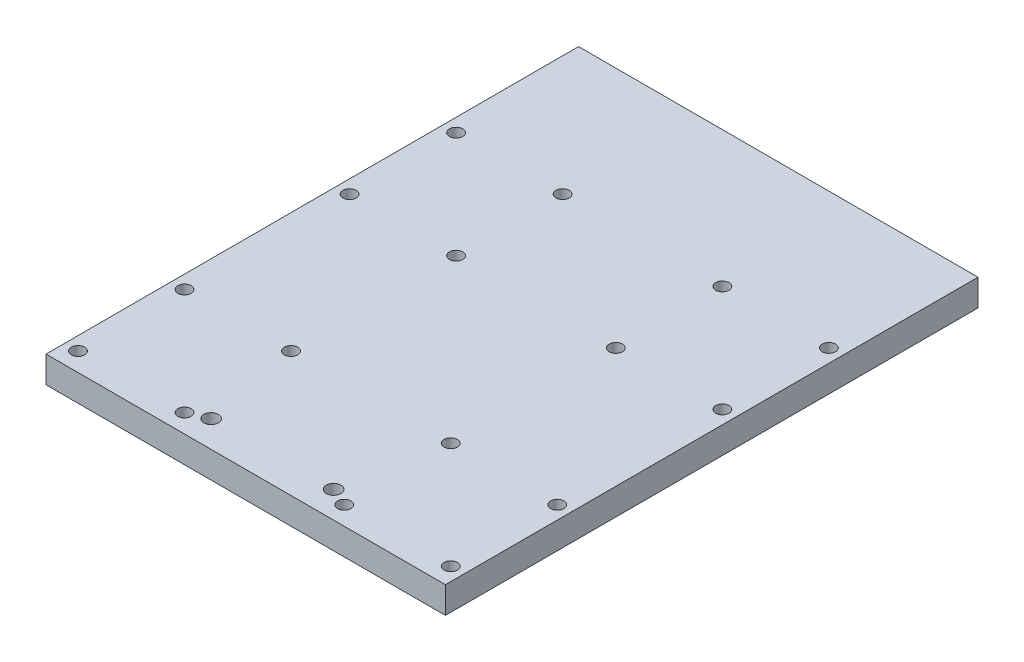
ISO-10303-21;
HEADER;
FILE_DESCRIPTION(('STEP AP214'),'2;1');
FILE_NAME('part.step','',(''),(''),'','','');
FILE_SCHEMA(('AUTOMOTIVE_DESIGN { 1 0 10303 214 1 1 1 1 }'));
ENDSEC;
DATA;
#1=APPLICATION_CONTEXT('core data for automotive mechanical design processes');
#2=APPLICATION_PROTOCOL_DEFINITION('international standard','automotive_design',2000,#1);
#3=PRODUCT_CONTEXT('',#1,'mechanical');
#4=PRODUCT('Part','Part','',(#3));
#5=PRODUCT_RELATED_PRODUCT_CATEGORY('part','',(#4));
#6=PRODUCT_DEFINITION_FORMATION('','',#4);
#7=PRODUCT_DEFINITION_CONTEXT('part definition',#1,'design');
#8=PRODUCT_DEFINITION('design','',#6,#7);
#9=PRODUCT_DEFINITION_SHAPE('','',#8);
#10=(LENGTH_UNIT() NAMED_UNIT(*) SI_UNIT(.MILLI.,.METRE.));
#11=(NAMED_UNIT(*) PLANE_ANGLE_UNIT() SI_UNIT($,.RADIAN.));
#12=(NAMED_UNIT(*) SI_UNIT($,.STERADIAN.) SOLID_ANGLE_UNIT());
#13=UNCERTAINTY_MEASURE_WITH_UNIT(LENGTH_MEASURE(1.E-05),#10,'distance_accuracy_value','');
#14=(GEOMETRIC_REPRESENTATION_CONTEXT(3) GLOBAL_UNCERTAINTY_ASSIGNED_CONTEXT((#13)) GLOBAL_UNIT_ASSIGNED_CONTEXT((#10,
#11,#12)) REPRESENTATION_CONTEXT('',''));
#15=CARTESIAN_POINT('',(0.,0.,0.));
#16=DIRECTION('',(0.,0.,1.));
#17=DIRECTION('',(1.,0.,0.));
#18=AXIS2_PLACEMENT_3D('',#15,#16,#17);
#19=CARTESIAN_POINT('',(-75.,10.,100.));
#20=DIRECTION('',(1.,0.,0.));
#21=DIRECTION('',(0.,0.,-1.));
#22=AXIS2_PLACEMENT_3D('',#19,#20,#21);
#23=PLANE('',#22);
#24=DIRECTION('',(0.,0.,1.));
#25=VECTOR('',#24,1.);
#26=CARTESIAN_POINT('',(-75.,0.,100.));
#27=LINE('',#26,#25);
#28=CARTESIAN_POINT('',(-75.,0.,-100.));
#29=VERTEX_POINT('',#28);
#30=CARTESIAN_POINT('',(-75.,0.,100.));
#31=VERTEX_POINT('',#30);
#32=EDGE_CURVE('E96',#29,#31,#27,.T.);
#33=ORIENTED_EDGE('',*,*,#32,.T.);
#34=DIRECTION('',(0.,-1.,0.));
#35=VECTOR('',#34,1.);
#36=CARTESIAN_POINT('',(-75.,10.,100.));
#37=LINE('',#36,#35);
#38=CARTESIAN_POINT('',(-75.,10.,100.));
#39=VERTEX_POINT('',#38);
#40=EDGE_CURVE('E11',#39,#31,#37,.T.);
#41=ORIENTED_EDGE('',*,*,#40,.F.);
#42=DIRECTION('',(0.,0.,1.));
#43=VECTOR('',#42,1.);
#44=CARTESIAN_POINT('',(-75.,10.,100.));
#45=LINE('',#44,#43);
#46=CARTESIAN_POINT('',(-75.,10.,-100.));
#47=VERTEX_POINT('',#46);
#48=EDGE_CURVE('E84',#47,#39,#45,.T.);
#49=ORIENTED_EDGE('',*,*,#48,.F.);
#50=DIRECTION('',(0.,-1.,0.));
#51=VECTOR('',#50,1.);
#52=CARTESIAN_POINT('',(-75.,10.,-100.));
#53=LINE('',#52,#51);
#54=EDGE_CURVE('E92',#47,#29,#53,.T.);
#55=ORIENTED_EDGE('',*,*,#54,.T.);
#56=EDGE_LOOP('',(#33,#41,#49,#55));
#57=FACE_BOUND('',#56,.T.);
#58=ADVANCED_FACE('F33',(#57),#23,.F.);
#59=CARTESIAN_POINT('',(75.,10.,100.));
#60=DIRECTION('',(0.,0.,-1.));
#61=DIRECTION('',(-1.,0.,0.));
#62=AXIS2_PLACEMENT_3D('',#59,#60,#61);
#63=PLANE('',#62);
#64=DIRECTION('',(1.,0.,0.));
#65=VECTOR('',#64,1.);
#66=CARTESIAN_POINT('',(75.,0.,100.));
#67=LINE('',#66,#65);
#68=CARTESIAN_POINT('',(75.,0.,100.));
#69=VERTEX_POINT('',#68);
#70=EDGE_CURVE('E88',#31,#69,#67,.T.);
#71=ORIENTED_EDGE('',*,*,#70,.T.);
#72=DIRECTION('',(0.,-1.,0.));
#73=VECTOR('',#72,1.);
#74=CARTESIAN_POINT('',(75.,10.,100.));
#75=LINE('',#74,#73);
#76=CARTESIAN_POINT('',(75.,10.,100.));
#77=VERTEX_POINT('',#76);
#78=EDGE_CURVE('E41',#77,#69,#75,.T.);
#79=ORIENTED_EDGE('',*,*,#78,.F.);
#80=DIRECTION('',(1.,0.,0.));
#81=VECTOR('',#80,1.);
#82=CARTESIAN_POINT('',(75.,10.,100.));
#83=LINE('',#82,#81);
#84=EDGE_CURVE('E79',#39,#77,#83,.T.);
#85=ORIENTED_EDGE('',*,*,#84,.F.);
#86=ORIENTED_EDGE('',*,*,#40,.T.);
#87=EDGE_LOOP('',(#71,#79,#85,#86));
#88=FACE_BOUND('',#87,.T.);
#89=ADVANCED_FACE('F87',(#88),#63,.F.);
#90=CARTESIAN_POINT('',(75.,10.,100.));
#91=DIRECTION('',(-1.,0.,0.));
#92=DIRECTION('',(0.,0.,1.));
#93=AXIS2_PLACEMENT_3D('',#90,#91,#92);
#94=PLANE('',#93);
#95=DIRECTION('',(0.,0.,-1.));
#96=VECTOR('',#95,1.);
#97=CARTESIAN_POINT('',(75.,0.,100.));
#98=LINE('',#97,#96);
#99=CARTESIAN_POINT('',(75.,0.,-100.));
#100=VERTEX_POINT('',#99);
#101=EDGE_CURVE('E66',#69,#100,#98,.T.);
#102=ORIENTED_EDGE('',*,*,#101,.T.);
#103=DIRECTION('',(0.,-1.,0.));
#104=VECTOR('',#103,1.);
#105=CARTESIAN_POINT('',(75.,10.,-100.));
#106=LINE('',#105,#104);
#107=CARTESIAN_POINT('',(75.,10.,-100.));
#108=VERTEX_POINT('',#107);
#109=EDGE_CURVE('E89',#108,#100,#106,.T.);
#110=ORIENTED_EDGE('',*,*,#109,.F.);
#111=DIRECTION('',(0.,0.,-1.));
#112=VECTOR('',#111,1.);
#113=CARTESIAN_POINT('',(75.,10.,100.));
#114=LINE('',#113,#112);
#115=EDGE_CURVE('E82',#77,#108,#114,.T.);
#116=ORIENTED_EDGE('',*,*,#115,.F.);
#117=ORIENTED_EDGE('',*,*,#78,.T.);
#118=EDGE_LOOP('',(#102,#110,#116,#117));
#119=FACE_BOUND('',#118,.T.);
#120=ADVANCED_FACE('F90',(#119),#94,.F.);
#121=CARTESIAN_POINT('',(75.,10.,-100.));
#122=DIRECTION('',(0.,0.,1.));
#123=DIRECTION('',(1.,0.,0.));
#124=AXIS2_PLACEMENT_3D('',#121,#122,#123);
#125=PLANE('',#124);
#126=DIRECTION('',(-1.,0.,0.));
#127=VECTOR('',#126,1.);
#128=CARTESIAN_POINT('',(75.,0.,-100.));
#129=LINE('',#128,#127);
#130=EDGE_CURVE('E72',#100,#29,#129,.T.);
#131=ORIENTED_EDGE('',*,*,#130,.T.);
#132=ORIENTED_EDGE('',*,*,#54,.F.);
#133=DIRECTION('',(-1.,0.,0.));
#134=VECTOR('',#133,1.);
#135=CARTESIAN_POINT('',(75.,10.,-100.));
#136=LINE('',#135,#134);
#137=EDGE_CURVE('E49',#108,#47,#136,.T.);
#138=ORIENTED_EDGE('',*,*,#137,.F.);
#139=ORIENTED_EDGE('',*,*,#109,.T.);
#140=EDGE_LOOP('',(#131,#132,#138,#139));
#141=FACE_BOUND('',#140,.T.);
#142=ADVANCED_FACE('F104',(#141),#125,.F.);
#143=CARTESIAN_POINT('',(0.,10.,0.));
#144=DIRECTION('',(0.,1.,0.));
#145=DIRECTION('',(0.,0.,1.));
#146=AXIS2_PLACEMENT_3D('',#143,#144,#145);
#147=PLANE('',#146);
#148=CARTESIAN_POINT('',(23.,10.,90.0000000000001));
#149=DIRECTION('',(0.,-1.,0.));
#150=DIRECTION('',(0.,0.,1.));
#151=AXIS2_PLACEMENT_3D('',#148,#149,#150);
#152=CIRCLE('',#151,2.75);
#153=CARTESIAN_POINT('',(23.,10.,92.7500000000001));
#154=VERTEX_POINT('',#153);
#155=EDGE_CURVE('E209',#154,#154,#152,.T.);
#156=ORIENTED_EDGE('',*,*,#155,.T.);
#157=EDGE_LOOP('',(#156));
#158=FACE_BOUND('',#157,.T.);
#159=CARTESIAN_POINT('',(70.0000000000011,10.,-9.00000000000001));
#160=DIRECTION('',(0.,-1.,0.));
#161=DIRECTION('',(0.,0.,1.));
#162=AXIS2_PLACEMENT_3D('',#159,#160,#161);
#163=CIRCLE('',#162,2.50000000000001);
#164=CARTESIAN_POINT('',(70.0000000000011,10.,-6.5));
#165=VERTEX_POINT('',#164);
#166=EDGE_CURVE('E203',#165,#165,#163,.T.);
#167=ORIENTED_EDGE('',*,*,#166,.T.);
#168=EDGE_LOOP('',(#167));
#169=FACE_BOUND('',#168,.T.);
#170=CARTESIAN_POINT('',(30.0000000000011,10.,-9.00000000000001));
#171=DIRECTION('',(0.,-1.,0.));
#172=DIRECTION('',(0.,0.,1.));
#173=AXIS2_PLACEMENT_3D('',#170,#171,#172);
#174=CIRCLE('',#173,2.5);
#175=CARTESIAN_POINT('',(30.0000000000011,10.,-6.50000000000001));
#176=VERTEX_POINT('',#175);
#177=EDGE_CURVE('E197',#176,#176,#174,.T.);
#178=ORIENTED_EDGE('',*,*,#177,.T.);
#179=EDGE_LOOP('',(#178));
#180=FACE_BOUND('',#179,.T.);
#181=CARTESIAN_POINT('',(30.0000000000011,10.,-49.));
#182=DIRECTION('',(0.,-1.,0.));
#183=DIRECTION('',(0.,0.,1.));
#184=AXIS2_PLACEMENT_3D('',#181,#182,#183);
#185=CIRCLE('',#184,2.5);
#186=CARTESIAN_POINT('',(30.0000000000011,10.,-46.5));
#187=VERTEX_POINT('',#186);
#188=EDGE_CURVE('E191',#187,#187,#185,.T.);
#189=ORIENTED_EDGE('',*,*,#188,.T.);
#190=EDGE_LOOP('',(#189));
#191=FACE_BOUND('',#190,.T.);
#192=CARTESIAN_POINT('',(70.0000000000011,10.,-49.));
#193=DIRECTION('',(0.,-1.,0.));
#194=DIRECTION('',(0.,0.,1.));
#195=AXIS2_PLACEMENT_3D('',#192,#193,#194);
#196=CIRCLE('',#195,2.50000000000001);
#197=CARTESIAN_POINT('',(70.0000000000011,10.,-46.5));
#198=VERTEX_POINT('',#197);
#199=EDGE_CURVE('E185',#198,#198,#196,.T.);
#200=ORIENTED_EDGE('',*,*,#199,.T.);
#201=EDGE_LOOP('',(#200));
#202=FACE_BOUND('',#201,.T.);
#203=CARTESIAN_POINT('',(-69.9999999999989,10.,-49.));
#204=DIRECTION('',(0.,-1.,0.));
#205=DIRECTION('',(0.,0.,-1.));
#206=AXIS2_PLACEMENT_3D('',#203,#204,#205);
#207=CIRCLE('',#206,2.50000000000001);
#208=CARTESIAN_POINT('',(-69.9999999999989,10.,-51.5));
#209=VERTEX_POINT('',#208);
#210=EDGE_CURVE('E179',#209,#209,#207,.T.);
#211=ORIENTED_EDGE('',*,*,#210,.T.);
#212=EDGE_LOOP('',(#211));
#213=FACE_BOUND('',#212,.T.);
#214=CARTESIAN_POINT('',(-29.9999999999989,10.,-49.));
#215=DIRECTION('',(0.,-1.,0.));
#216=DIRECTION('',(0.,0.,-1.));
#217=AXIS2_PLACEMENT_3D('',#214,#215,#216);
#218=CIRCLE('',#217,2.5);
#219=CARTESIAN_POINT('',(-29.9999999999989,10.,-51.5));
#220=VERTEX_POINT('',#219);
#221=EDGE_CURVE('E173',#220,#220,#218,.T.);
#222=ORIENTED_EDGE('',*,*,#221,.T.);
#223=EDGE_LOOP('',(#222));
#224=FACE_BOUND('',#223,.T.);
#225=CARTESIAN_POINT('',(-29.9999999999989,10.,-9.00000000000002));
#226=DIRECTION('',(0.,-1.,0.));
#227=DIRECTION('',(0.,0.,-1.));
#228=AXIS2_PLACEMENT_3D('',#225,#226,#227);
#229=CIRCLE('',#228,2.5);
#230=CARTESIAN_POINT('',(-29.9999999999989,10.,-11.5));
#231=VERTEX_POINT('',#230);
#232=EDGE_CURVE('E167',#231,#231,#229,.T.);
#233=ORIENTED_EDGE('',*,*,#232,.T.);
#234=EDGE_LOOP('',(#233));
#235=FACE_BOUND('',#234,.T.);
#236=CARTESIAN_POINT('',(-69.9999999999989,10.,-9.00000000000002));
#237=DIRECTION('',(0.,-1.,0.));
#238=DIRECTION('',(0.,0.,-1.));
#239=AXIS2_PLACEMENT_3D('',#236,#237,#238);
#240=CIRCLE('',#239,2.50000000000001);
#241=CARTESIAN_POINT('',(-69.9999999999989,10.,-11.5));
#242=VERTEX_POINT('',#241);
#243=EDGE_CURVE('E161',#242,#242,#240,.T.);
#244=ORIENTED_EDGE('',*,*,#243,.T.);
#245=EDGE_LOOP('',(#244));
#246=FACE_BOUND('',#245,.T.);
#247=CARTESIAN_POINT('',(-23.,10.,90.0000000000001));
#248=DIRECTION('',(0.,-1.,0.));
#249=DIRECTION('',(0.,0.,-1.));
#250=AXIS2_PLACEMENT_3D('',#247,#248,#249);
#251=CIRCLE('',#250,2.75);
#252=CARTESIAN_POINT('',(-23.,10.,87.2500000000001));
#253=VERTEX_POINT('',#252);
#254=EDGE_CURVE('E155',#253,#253,#251,.T.);
#255=ORIENTED_EDGE('',*,*,#254,.T.);
#256=EDGE_LOOP('',(#255));
#257=FACE_BOUND('',#256,.T.);
#258=CARTESIAN_POINT('',(70.,10.,93.));
#259=DIRECTION('',(0.,-1.,0.));
#260=DIRECTION('',(0.,0.,1.));
#261=AXIS2_PLACEMENT_3D('',#258,#259,#260);
#262=CIRCLE('',#261,2.50000000000001);
#263=CARTESIAN_POINT('',(70.,10.,95.5));
#264=VERTEX_POINT('',#263);
#265=EDGE_CURVE('E149',#264,#264,#262,.T.);
#266=ORIENTED_EDGE('',*,*,#265,.T.);
#267=EDGE_LOOP('',(#266));
#268=FACE_BOUND('',#267,.T.);
#269=CARTESIAN_POINT('',(30.,10.,93.));
#270=DIRECTION('',(0.,-1.,0.));
#271=DIRECTION('',(0.,0.,1.));
#272=AXIS2_PLACEMENT_3D('',#269,#270,#271);
#273=CIRCLE('',#272,2.5);
#274=CARTESIAN_POINT('',(30.,10.,95.5));
#275=VERTEX_POINT('',#274);
#276=EDGE_CURVE('E143',#275,#275,#273,.T.);
#277=ORIENTED_EDGE('',*,*,#276,.T.);
#278=EDGE_LOOP('',(#277));
#279=FACE_BOUND('',#278,.T.);
#280=CARTESIAN_POINT('',(30.,10.,53.));
#281=DIRECTION('',(0.,-1.,0.));
#282=DIRECTION('',(0.,0.,1.));
#283=AXIS2_PLACEMENT_3D('',#280,#281,#282);
#284=CIRCLE('',#283,2.5);
#285=CARTESIAN_POINT('',(30.,10.,55.5));
#286=VERTEX_POINT('',#285);
#287=EDGE_CURVE('E137',#286,#286,#284,.T.);
#288=ORIENTED_EDGE('',*,*,#287,.T.);
#289=EDGE_LOOP('',(#288));
#290=FACE_BOUND('',#289,.T.);
#291=CARTESIAN_POINT('',(70.,10.,53.));
#292=DIRECTION('',(0.,-1.,0.));
#293=DIRECTION('',(0.,0.,1.));
#294=AXIS2_PLACEMENT_3D('',#291,#292,#293);
#295=CIRCLE('',#294,2.5);
#296=CARTESIAN_POINT('',(70.,10.,55.5));
#297=VERTEX_POINT('',#296);
#298=EDGE_CURVE('E131',#297,#297,#295,.T.);
#299=ORIENTED_EDGE('',*,*,#298,.T.);
#300=EDGE_LOOP('',(#299));
#301=FACE_BOUND('',#300,.T.);
#302=CARTESIAN_POINT('',(-70.,10.,53.));
#303=DIRECTION('',(0.,-1.,0.));
#304=DIRECTION('',(0.,0.,-1.));
#305=AXIS2_PLACEMENT_3D('',#302,#303,#304);
#306=CIRCLE('',#305,2.5);
#307=CARTESIAN_POINT('',(-70.,10.,50.5));
#308=VERTEX_POINT('',#307);
#309=EDGE_CURVE('E125',#308,#308,#306,.T.);
#310=ORIENTED_EDGE('',*,*,#309,.T.);
#311=EDGE_LOOP('',(#310));
#312=FACE_BOUND('',#311,.T.);
#313=CARTESIAN_POINT('',(-30.,10.,53.));
#314=DIRECTION('',(0.,-1.,0.));
#315=DIRECTION('',(0.,0.,-1.));
#316=AXIS2_PLACEMENT_3D('',#313,#314,#315);
#317=CIRCLE('',#316,2.5);
#318=CARTESIAN_POINT('',(-30.,10.,50.5));
#319=VERTEX_POINT('',#318);
#320=EDGE_CURVE('E119',#319,#319,#317,.T.);
#321=ORIENTED_EDGE('',*,*,#320,.T.);
#322=EDGE_LOOP('',(#321));
#323=FACE_BOUND('',#322,.T.);
#324=CARTESIAN_POINT('',(-30.,10.,93.));
#325=DIRECTION('',(0.,-1.,0.));
#326=DIRECTION('',(0.,0.,-1.));
#327=AXIS2_PLACEMENT_3D('',#324,#325,#326);
#328=CIRCLE('',#327,2.5);
#329=CARTESIAN_POINT('',(-30.,10.,90.5));
#330=VERTEX_POINT('',#329);
#331=EDGE_CURVE('E113',#330,#330,#328,.T.);
#332=ORIENTED_EDGE('',*,*,#331,.T.);
#333=EDGE_LOOP('',(#332));
#334=FACE_BOUND('',#333,.T.);
#335=CARTESIAN_POINT('',(-70.,10.,93.));
#336=DIRECTION('',(0.,-1.,0.));
#337=DIRECTION('',(0.,0.,-1.));
#338=AXIS2_PLACEMENT_3D('',#335,#336,#337);
#339=CIRCLE('',#338,2.50000000000001);
#340=CARTESIAN_POINT('',(-70.,10.,90.5));
#341=VERTEX_POINT('',#340);
#342=EDGE_CURVE('E99',#341,#341,#339,.T.);
#343=ORIENTED_EDGE('',*,*,#342,.T.);
#344=EDGE_LOOP('',(#343));
#345=FACE_BOUND('',#344,.T.);
#346=ORIENTED_EDGE('',*,*,#48,.T.);
#347=ORIENTED_EDGE('',*,*,#84,.T.);
#348=ORIENTED_EDGE('',*,*,#115,.T.);
#349=ORIENTED_EDGE('',*,*,#137,.T.);
#350=EDGE_LOOP('',(#346,#347,#348,#349));
#351=FACE_BOUND('',#350,.T.);
#352=ADVANCED_FACE('F80',(#158,#169,#180,#191,#202,#213,#224,#235,#246,#257,#268,#279,#290,#301,
#312,#323,#334,#345,#351),#147,.T.);
#353=CARTESIAN_POINT('',(0.,0.,0.));
#354=DIRECTION('',(0.,1.,0.));
#355=DIRECTION('',(0.,0.,1.));
#356=AXIS2_PLACEMENT_3D('',#353,#354,#355);
#357=PLANE('',#356);
#358=CARTESIAN_POINT('',(23.,0.,90.0000000000001));
#359=DIRECTION('',(0.,-1.,0.));
#360=DIRECTION('',(0.,0.,1.));
#361=AXIS2_PLACEMENT_3D('',#358,#359,#360);
#362=CIRCLE('',#361,2.75);
#363=CARTESIAN_POINT('',(23.,0.,92.7500000000001));
#364=VERTEX_POINT('',#363);
#365=EDGE_CURVE('E212',#364,#364,#362,.T.);
#366=ORIENTED_EDGE('',*,*,#365,.F.);
#367=EDGE_LOOP('',(#366));
#368=FACE_BOUND('',#367,.T.);
#369=CARTESIAN_POINT('',(70.0000000000011,0.,-9.00000000000001));
#370=DIRECTION('',(0.,-1.,0.));
#371=DIRECTION('',(0.,0.,1.));
#372=AXIS2_PLACEMENT_3D('',#369,#370,#371);
#373=CIRCLE('',#372,2.50000000000001);
#374=CARTESIAN_POINT('',(70.0000000000011,0.,-6.5));
#375=VERTEX_POINT('',#374);
#376=EDGE_CURVE('E206',#375,#375,#373,.T.);
#377=ORIENTED_EDGE('',*,*,#376,.F.);
#378=EDGE_LOOP('',(#377));
#379=FACE_BOUND('',#378,.T.);
#380=CARTESIAN_POINT('',(30.0000000000011,0.,-9.00000000000001));
#381=DIRECTION('',(0.,-1.,0.));
#382=DIRECTION('',(0.,0.,1.));
#383=AXIS2_PLACEMENT_3D('',#380,#381,#382);
#384=CIRCLE('',#383,2.5);
#385=CARTESIAN_POINT('',(30.0000000000011,0.,-6.50000000000001));
#386=VERTEX_POINT('',#385);
#387=EDGE_CURVE('E200',#386,#386,#384,.T.);
#388=ORIENTED_EDGE('',*,*,#387,.F.);
#389=EDGE_LOOP('',(#388));
#390=FACE_BOUND('',#389,.T.);
#391=CARTESIAN_POINT('',(30.0000000000011,0.,-49.));
#392=DIRECTION('',(0.,-1.,0.));
#393=DIRECTION('',(0.,0.,1.));
#394=AXIS2_PLACEMENT_3D('',#391,#392,#393);
#395=CIRCLE('',#394,2.5);
#396=CARTESIAN_POINT('',(30.0000000000011,0.,-46.5));
#397=VERTEX_POINT('',#396);
#398=EDGE_CURVE('E194',#397,#397,#395,.T.);
#399=ORIENTED_EDGE('',*,*,#398,.F.);
#400=EDGE_LOOP('',(#399));
#401=FACE_BOUND('',#400,.T.);
#402=CARTESIAN_POINT('',(70.0000000000011,0.,-49.));
#403=DIRECTION('',(0.,-1.,0.));
#404=DIRECTION('',(0.,0.,1.));
#405=AXIS2_PLACEMENT_3D('',#402,#403,#404);
#406=CIRCLE('',#405,2.50000000000001);
#407=CARTESIAN_POINT('',(70.0000000000011,0.,-46.5));
#408=VERTEX_POINT('',#407);
#409=EDGE_CURVE('E188',#408,#408,#406,.T.);
#410=ORIENTED_EDGE('',*,*,#409,.F.);
#411=EDGE_LOOP('',(#410));
#412=FACE_BOUND('',#411,.T.);
#413=CARTESIAN_POINT('',(-69.9999999999989,0.,-49.));
#414=DIRECTION('',(0.,-1.,0.));
#415=DIRECTION('',(0.,0.,-1.));
#416=AXIS2_PLACEMENT_3D('',#413,#414,#415);
#417=CIRCLE('',#416,2.50000000000001);
#418=CARTESIAN_POINT('',(-69.9999999999989,0.,-51.5));
#419=VERTEX_POINT('',#418);
#420=EDGE_CURVE('E182',#419,#419,#417,.T.);
#421=ORIENTED_EDGE('',*,*,#420,.F.);
#422=EDGE_LOOP('',(#421));
#423=FACE_BOUND('',#422,.T.);
#424=CARTESIAN_POINT('',(-29.9999999999989,0.,-49.));
#425=DIRECTION('',(0.,-1.,0.));
#426=DIRECTION('',(0.,0.,-1.));
#427=AXIS2_PLACEMENT_3D('',#424,#425,#426);
#428=CIRCLE('',#427,2.5);
#429=CARTESIAN_POINT('',(-29.9999999999989,0.,-51.5));
#430=VERTEX_POINT('',#429);
#431=EDGE_CURVE('E176',#430,#430,#428,.T.);
#432=ORIENTED_EDGE('',*,*,#431,.F.);
#433=EDGE_LOOP('',(#432));
#434=FACE_BOUND('',#433,.T.);
#435=CARTESIAN_POINT('',(-29.9999999999989,0.,-9.00000000000002));
#436=DIRECTION('',(0.,-1.,0.));
#437=DIRECTION('',(0.,0.,-1.));
#438=AXIS2_PLACEMENT_3D('',#435,#436,#437);
#439=CIRCLE('',#438,2.5);
#440=CARTESIAN_POINT('',(-29.9999999999989,0.,-11.5));
#441=VERTEX_POINT('',#440);
#442=EDGE_CURVE('E170',#441,#441,#439,.T.);
#443=ORIENTED_EDGE('',*,*,#442,.F.);
#444=EDGE_LOOP('',(#443));
#445=FACE_BOUND('',#444,.T.);
#446=CARTESIAN_POINT('',(-69.9999999999989,0.,-9.00000000000002));
#447=DIRECTION('',(0.,-1.,0.));
#448=DIRECTION('',(0.,0.,-1.));
#449=AXIS2_PLACEMENT_3D('',#446,#447,#448);
#450=CIRCLE('',#449,2.50000000000001);
#451=CARTESIAN_POINT('',(-69.9999999999989,0.,-11.5));
#452=VERTEX_POINT('',#451);
#453=EDGE_CURVE('E164',#452,#452,#450,.T.);
#454=ORIENTED_EDGE('',*,*,#453,.F.);
#455=EDGE_LOOP('',(#454));
#456=FACE_BOUND('',#455,.T.);
#457=CARTESIAN_POINT('',(-23.,0.,90.0000000000001));
#458=DIRECTION('',(0.,-1.,0.));
#459=DIRECTION('',(0.,0.,-1.));
#460=AXIS2_PLACEMENT_3D('',#457,#458,#459);
#461=CIRCLE('',#460,2.75);
#462=CARTESIAN_POINT('',(-23.,0.,87.2500000000001));
#463=VERTEX_POINT('',#462);
#464=EDGE_CURVE('E158',#463,#463,#461,.T.);
#465=ORIENTED_EDGE('',*,*,#464,.F.);
#466=EDGE_LOOP('',(#465));
#467=FACE_BOUND('',#466,.T.);
#468=CARTESIAN_POINT('',(70.,0.,93.));
#469=DIRECTION('',(0.,-1.,0.));
#470=DIRECTION('',(0.,0.,1.));
#471=AXIS2_PLACEMENT_3D('',#468,#469,#470);
#472=CIRCLE('',#471,2.50000000000001);
#473=CARTESIAN_POINT('',(70.,0.,95.5));
#474=VERTEX_POINT('',#473);
#475=EDGE_CURVE('E152',#474,#474,#472,.T.);
#476=ORIENTED_EDGE('',*,*,#475,.F.);
#477=EDGE_LOOP('',(#476));
#478=FACE_BOUND('',#477,.T.);
#479=CARTESIAN_POINT('',(30.,0.,93.));
#480=DIRECTION('',(0.,-1.,0.));
#481=DIRECTION('',(0.,0.,1.));
#482=AXIS2_PLACEMENT_3D('',#479,#480,#481);
#483=CIRCLE('',#482,2.5);
#484=CARTESIAN_POINT('',(30.,0.,95.5));
#485=VERTEX_POINT('',#484);
#486=EDGE_CURVE('E146',#485,#485,#483,.T.);
#487=ORIENTED_EDGE('',*,*,#486,.F.);
#488=EDGE_LOOP('',(#487));
#489=FACE_BOUND('',#488,.T.);
#490=CARTESIAN_POINT('',(30.,0.,53.));
#491=DIRECTION('',(0.,-1.,0.));
#492=DIRECTION('',(0.,0.,1.));
#493=AXIS2_PLACEMENT_3D('',#490,#491,#492);
#494=CIRCLE('',#493,2.5);
#495=CARTESIAN_POINT('',(30.,0.,55.5));
#496=VERTEX_POINT('',#495);
#497=EDGE_CURVE('E140',#496,#496,#494,.T.);
#498=ORIENTED_EDGE('',*,*,#497,.F.);
#499=EDGE_LOOP('',(#498));
#500=FACE_BOUND('',#499,.T.);
#501=CARTESIAN_POINT('',(70.,0.,53.));
#502=DIRECTION('',(0.,-1.,0.));
#503=DIRECTION('',(0.,0.,1.));
#504=AXIS2_PLACEMENT_3D('',#501,#502,#503);
#505=CIRCLE('',#504,2.5);
#506=CARTESIAN_POINT('',(70.,0.,55.5));
#507=VERTEX_POINT('',#506);
#508=EDGE_CURVE('E134',#507,#507,#505,.T.);
#509=ORIENTED_EDGE('',*,*,#508,.F.);
#510=EDGE_LOOP('',(#509));
#511=FACE_BOUND('',#510,.T.);
#512=CARTESIAN_POINT('',(-70.,0.,53.));
#513=DIRECTION('',(0.,-1.,0.));
#514=DIRECTION('',(0.,0.,-1.));
#515=AXIS2_PLACEMENT_3D('',#512,#513,#514);
#516=CIRCLE('',#515,2.5);
#517=CARTESIAN_POINT('',(-70.,0.,50.5));
#518=VERTEX_POINT('',#517);
#519=EDGE_CURVE('E128',#518,#518,#516,.T.);
#520=ORIENTED_EDGE('',*,*,#519,.F.);
#521=EDGE_LOOP('',(#520));
#522=FACE_BOUND('',#521,.T.);
#523=CARTESIAN_POINT('',(-30.,0.,53.));
#524=DIRECTION('',(0.,-1.,0.));
#525=DIRECTION('',(0.,0.,-1.));
#526=AXIS2_PLACEMENT_3D('',#523,#524,#525);
#527=CIRCLE('',#526,2.5);
#528=CARTESIAN_POINT('',(-30.,0.,50.5));
#529=VERTEX_POINT('',#528);
#530=EDGE_CURVE('E122',#529,#529,#527,.T.);
#531=ORIENTED_EDGE('',*,*,#530,.F.);
#532=EDGE_LOOP('',(#531));
#533=FACE_BOUND('',#532,.T.);
#534=CARTESIAN_POINT('',(-30.,0.,93.));
#535=DIRECTION('',(0.,-1.,0.));
#536=DIRECTION('',(0.,0.,-1.));
#537=AXIS2_PLACEMENT_3D('',#534,#535,#536);
#538=CIRCLE('',#537,2.5);
#539=CARTESIAN_POINT('',(-30.,0.,90.5));
#540=VERTEX_POINT('',#539);
#541=EDGE_CURVE('E116',#540,#540,#538,.T.);
#542=ORIENTED_EDGE('',*,*,#541,.F.);
#543=EDGE_LOOP('',(#542));
#544=FACE_BOUND('',#543,.T.);
#545=CARTESIAN_POINT('',(-70.,0.,93.));
#546=DIRECTION('',(0.,-1.,0.));
#547=DIRECTION('',(0.,0.,-1.));
#548=AXIS2_PLACEMENT_3D('',#545,#546,#547);
#549=CIRCLE('',#548,2.50000000000001);
#550=CARTESIAN_POINT('',(-70.,0.,90.5));
#551=VERTEX_POINT('',#550);
#552=EDGE_CURVE('E110',#551,#551,#549,.T.);
#553=ORIENTED_EDGE('',*,*,#552,.F.);
#554=EDGE_LOOP('',(#553));
#555=FACE_BOUND('',#554,.T.);
#556=ORIENTED_EDGE('',*,*,#32,.F.);
#557=ORIENTED_EDGE('',*,*,#130,.F.);
#558=ORIENTED_EDGE('',*,*,#101,.F.);
#559=ORIENTED_EDGE('',*,*,#70,.F.);
#560=EDGE_LOOP('',(#556,#557,#558,#559));
#561=FACE_BOUND('',#560,.T.);
#562=ADVANCED_FACE('F107',(#368,#379,#390,#401,#412,#423,#434,#445,#456,#467,#478,#489,#500,
#511,#522,#533,#544,#555,#561),#357,.F.);
#563=CARTESIAN_POINT('',(-70.,10.,93.));
#564=DIRECTION('',(0.,-1.,0.));
#565=DIRECTION('',(0.,0.,-1.));
#566=AXIS2_PLACEMENT_3D('',#563,#564,#565);
#567=CYLINDRICAL_SURFACE('',#566,2.50000000000001);
#568=ORIENTED_EDGE('',*,*,#342,.F.);
#569=EDGE_LOOP('',(#568));
#570=FACE_BOUND('',#569,.T.);
#571=ORIENTED_EDGE('',*,*,#552,.T.);
#572=EDGE_LOOP('',(#571));
#573=FACE_BOUND('',#572,.T.);
#574=ADVANCED_FACE('F229',(#570,#573),#567,.F.);
#575=CARTESIAN_POINT('',(-30.,10.,93.));
#576=DIRECTION('',(0.,-1.,0.));
#577=DIRECTION('',(0.,0.,-1.));
#578=AXIS2_PLACEMENT_3D('',#575,#576,#577);
#579=CYLINDRICAL_SURFACE('',#578,2.5);
#580=ORIENTED_EDGE('',*,*,#331,.F.);
#581=EDGE_LOOP('',(#580));
#582=FACE_BOUND('',#581,.T.);
#583=ORIENTED_EDGE('',*,*,#541,.T.);
#584=EDGE_LOOP('',(#583));
#585=FACE_BOUND('',#584,.T.);
#586=ADVANCED_FACE('F266',(#582,#585),#579,.F.);
#587=CARTESIAN_POINT('',(-30.,10.,53.));
#588=DIRECTION('',(0.,-1.,0.));
#589=DIRECTION('',(0.,0.,-1.));
#590=AXIS2_PLACEMENT_3D('',#587,#588,#589);
#591=CYLINDRICAL_SURFACE('',#590,2.5);
#592=ORIENTED_EDGE('',*,*,#320,.F.);
#593=EDGE_LOOP('',(#592));
#594=FACE_BOUND('',#593,.T.);
#595=ORIENTED_EDGE('',*,*,#530,.T.);
#596=EDGE_LOOP('',(#595));
#597=FACE_BOUND('',#596,.T.);
#598=ADVANCED_FACE('F273',(#594,#597),#591,.F.);
#599=CARTESIAN_POINT('',(-70.,10.,53.));
#600=DIRECTION('',(0.,-1.,0.));
#601=DIRECTION('',(0.,0.,-1.));
#602=AXIS2_PLACEMENT_3D('',#599,#600,#601);
#603=CYLINDRICAL_SURFACE('',#602,2.5);
#604=ORIENTED_EDGE('',*,*,#309,.F.);
#605=EDGE_LOOP('',(#604));
#606=FACE_BOUND('',#605,.T.);
#607=ORIENTED_EDGE('',*,*,#519,.T.);
#608=EDGE_LOOP('',(#607));
#609=FACE_BOUND('',#608,.T.);
#610=ADVANCED_FACE('F315',(#606,#609),#603,.F.);
#611=CARTESIAN_POINT('',(70.,10.,53.));
#612=DIRECTION('',(0.,-1.,0.));
#613=DIRECTION('',(0.,0.,-1.));
#614=AXIS2_PLACEMENT_3D('',#611,#612,#613);
#615=CYLINDRICAL_SURFACE('',#614,2.5);
#616=ORIENTED_EDGE('',*,*,#298,.F.);
#617=EDGE_LOOP('',(#616));
#618=FACE_BOUND('',#617,.T.);
#619=ORIENTED_EDGE('',*,*,#508,.T.);
#620=EDGE_LOOP('',(#619));
#621=FACE_BOUND('',#620,.T.);
#622=ADVANCED_FACE('F325',(#618,#621),#615,.F.);
#623=CARTESIAN_POINT('',(30.,10.,53.));
#624=DIRECTION('',(0.,-1.,0.));
#625=DIRECTION('',(0.,0.,-1.));
#626=AXIS2_PLACEMENT_3D('',#623,#624,#625);
#627=CYLINDRICAL_SURFACE('',#626,2.5);
#628=ORIENTED_EDGE('',*,*,#287,.F.);
#629=EDGE_LOOP('',(#628));
#630=FACE_BOUND('',#629,.T.);
#631=ORIENTED_EDGE('',*,*,#497,.T.);
#632=EDGE_LOOP('',(#631));
#633=FACE_BOUND('',#632,.T.);
#634=ADVANCED_FACE('F335',(#630,#633),#627,.F.);
#635=CARTESIAN_POINT('',(30.,10.,93.));
#636=DIRECTION('',(0.,-1.,0.));
#637=DIRECTION('',(0.,0.,-1.));
#638=AXIS2_PLACEMENT_3D('',#635,#636,#637);
#639=CYLINDRICAL_SURFACE('',#638,2.5);
#640=ORIENTED_EDGE('',*,*,#276,.F.);
#641=EDGE_LOOP('',(#640));
#642=FACE_BOUND('',#641,.T.);
#643=ORIENTED_EDGE('',*,*,#486,.T.);
#644=EDGE_LOOP('',(#643));
#645=FACE_BOUND('',#644,.T.);
#646=ADVANCED_FACE('F345',(#642,#645),#639,.F.);
#647=CARTESIAN_POINT('',(70.,10.,93.));
#648=DIRECTION('',(0.,-1.,0.));
#649=DIRECTION('',(0.,0.,-1.));
#650=AXIS2_PLACEMENT_3D('',#647,#648,#649);
#651=CYLINDRICAL_SURFACE('',#650,2.50000000000001);
#652=ORIENTED_EDGE('',*,*,#265,.F.);
#653=EDGE_LOOP('',(#652));
#654=FACE_BOUND('',#653,.T.);
#655=ORIENTED_EDGE('',*,*,#475,.T.);
#656=EDGE_LOOP('',(#655));
#657=FACE_BOUND('',#656,.T.);
#658=ADVANCED_FACE('F355',(#654,#657),#651,.F.);
#659=CARTESIAN_POINT('',(-23.,10.,90.0000000000001));
#660=DIRECTION('',(0.,-1.,0.));
#661=DIRECTION('',(0.,0.,-1.));
#662=AXIS2_PLACEMENT_3D('',#659,#660,#661);
#663=CYLINDRICAL_SURFACE('',#662,2.75);
#664=ORIENTED_EDGE('',*,*,#254,.F.);
#665=EDGE_LOOP('',(#664));
#666=FACE_BOUND('',#665,.T.);
#667=ORIENTED_EDGE('',*,*,#464,.T.);
#668=EDGE_LOOP('',(#667));
#669=FACE_BOUND('',#668,.T.);
#670=ADVANCED_FACE('F365',(#666,#669),#663,.F.);
#671=CARTESIAN_POINT('',(-69.9999999999989,10.,-9.00000000000002));
#672=DIRECTION('',(0.,-1.,0.));
#673=DIRECTION('',(0.,0.,-1.));
#674=AXIS2_PLACEMENT_3D('',#671,#672,#673);
#675=CYLINDRICAL_SURFACE('',#674,2.50000000000001);
#676=ORIENTED_EDGE('',*,*,#243,.F.);
#677=EDGE_LOOP('',(#676));
#678=FACE_BOUND('',#677,.T.);
#679=ORIENTED_EDGE('',*,*,#453,.T.);
#680=EDGE_LOOP('',(#679));
#681=FACE_BOUND('',#680,.T.);
#682=ADVANCED_FACE('F375',(#678,#681),#675,.F.);
#683=CARTESIAN_POINT('',(-29.9999999999989,10.,-9.00000000000002));
#684=DIRECTION('',(0.,-1.,0.));
#685=DIRECTION('',(0.,0.,-1.));
#686=AXIS2_PLACEMENT_3D('',#683,#684,#685);
#687=CYLINDRICAL_SURFACE('',#686,2.5);
#688=ORIENTED_EDGE('',*,*,#232,.F.);
#689=EDGE_LOOP('',(#688));
#690=FACE_BOUND('',#689,.T.);
#691=ORIENTED_EDGE('',*,*,#442,.T.);
#692=EDGE_LOOP('',(#691));
#693=FACE_BOUND('',#692,.T.);
#694=ADVANCED_FACE('F385',(#690,#693),#687,.F.);
#695=CARTESIAN_POINT('',(-29.9999999999989,10.,-49.));
#696=DIRECTION('',(0.,-1.,0.));
#697=DIRECTION('',(0.,0.,-1.));
#698=AXIS2_PLACEMENT_3D('',#695,#696,#697);
#699=CYLINDRICAL_SURFACE('',#698,2.5);
#700=ORIENTED_EDGE('',*,*,#221,.F.);
#701=EDGE_LOOP('',(#700));
#702=FACE_BOUND('',#701,.T.);
#703=ORIENTED_EDGE('',*,*,#431,.T.);
#704=EDGE_LOOP('',(#703));
#705=FACE_BOUND('',#704,.T.);
#706=ADVANCED_FACE('F395',(#702,#705),#699,.F.);
#707=CARTESIAN_POINT('',(-69.9999999999989,10.,-49.));
#708=DIRECTION('',(0.,-1.,0.));
#709=DIRECTION('',(0.,0.,-1.));
#710=AXIS2_PLACEMENT_3D('',#707,#708,#709);
#711=CYLINDRICAL_SURFACE('',#710,2.50000000000001);
#712=ORIENTED_EDGE('',*,*,#210,.F.);
#713=EDGE_LOOP('',(#712));
#714=FACE_BOUND('',#713,.T.);
#715=ORIENTED_EDGE('',*,*,#420,.T.);
#716=EDGE_LOOP('',(#715));
#717=FACE_BOUND('',#716,.T.);
#718=ADVANCED_FACE('F405',(#714,#717),#711,.F.);
#719=CARTESIAN_POINT('',(70.0000000000011,10.,-49.));
#720=DIRECTION('',(0.,-1.,0.));
#721=DIRECTION('',(0.,0.,-1.));
#722=AXIS2_PLACEMENT_3D('',#719,#720,#721);
#723=CYLINDRICAL_SURFACE('',#722,2.50000000000001);
#724=ORIENTED_EDGE('',*,*,#199,.F.);
#725=EDGE_LOOP('',(#724));
#726=FACE_BOUND('',#725,.T.);
#727=ORIENTED_EDGE('',*,*,#409,.T.);
#728=EDGE_LOOP('',(#727));
#729=FACE_BOUND('',#728,.T.);
#730=ADVANCED_FACE('F415',(#726,#729),#723,.F.);
#731=CARTESIAN_POINT('',(30.0000000000011,10.,-49.));
#732=DIRECTION('',(0.,-1.,0.));
#733=DIRECTION('',(0.,0.,-1.));
#734=AXIS2_PLACEMENT_3D('',#731,#732,#733);
#735=CYLINDRICAL_SURFACE('',#734,2.5);
#736=ORIENTED_EDGE('',*,*,#188,.F.);
#737=EDGE_LOOP('',(#736));
#738=FACE_BOUND('',#737,.T.);
#739=ORIENTED_EDGE('',*,*,#398,.T.);
#740=EDGE_LOOP('',(#739));
#741=FACE_BOUND('',#740,.T.);
#742=ADVANCED_FACE('F425',(#738,#741),#735,.F.);
#743=CARTESIAN_POINT('',(30.0000000000011,10.,-9.00000000000001));
#744=DIRECTION('',(0.,-1.,0.));
#745=DIRECTION('',(0.,0.,-1.));
#746=AXIS2_PLACEMENT_3D('',#743,#744,#745);
#747=CYLINDRICAL_SURFACE('',#746,2.5);
#748=ORIENTED_EDGE('',*,*,#177,.F.);
#749=EDGE_LOOP('',(#748));
#750=FACE_BOUND('',#749,.T.);
#751=ORIENTED_EDGE('',*,*,#387,.T.);
#752=EDGE_LOOP('',(#751));
#753=FACE_BOUND('',#752,.T.);
#754=ADVANCED_FACE('F435',(#750,#753),#747,.F.);
#755=CARTESIAN_POINT('',(70.0000000000011,10.,-9.00000000000001));
#756=DIRECTION('',(0.,-1.,0.));
#757=DIRECTION('',(0.,0.,-1.));
#758=AXIS2_PLACEMENT_3D('',#755,#756,#757);
#759=CYLINDRICAL_SURFACE('',#758,2.50000000000001);
#760=ORIENTED_EDGE('',*,*,#166,.F.);
#761=EDGE_LOOP('',(#760));
#762=FACE_BOUND('',#761,.T.);
#763=ORIENTED_EDGE('',*,*,#376,.T.);
#764=EDGE_LOOP('',(#763));
#765=FACE_BOUND('',#764,.T.);
#766=ADVANCED_FACE('F223',(#762,#765),#759,.F.);
#767=CARTESIAN_POINT('',(23.,10.,90.0000000000001));
#768=DIRECTION('',(0.,-1.,0.));
#769=DIRECTION('',(0.,0.,-1.));
#770=AXIS2_PLACEMENT_3D('',#767,#768,#769);
#771=CYLINDRICAL_SURFACE('',#770,2.75);
#772=ORIENTED_EDGE('',*,*,#155,.F.);
#773=EDGE_LOOP('',(#772));
#774=FACE_BOUND('',#773,.T.);
#775=ORIENTED_EDGE('',*,*,#365,.T.);
#776=EDGE_LOOP('',(#775));
#777=FACE_BOUND('',#776,.T.);
#778=ADVANCED_FACE('F220',(#774,#777),#771,.F.);
#779=CLOSED_SHELL('',(#58,#89,#120,#142,#352,#562,#574,#586,#598,#610,#622,#634,#646,#658,#670,
#682,#694,#706,#718,#730,#742,#754,#766,#778));
#780=MANIFOLD_SOLID_BREP('B2',#779);
#781=ADVANCED_BREP_SHAPE_REPRESENTATION('',(#18,#780),#14);
#782=SHAPE_DEFINITION_REPRESENTATION(#9,#781);
ENDSEC;
END-ISO-10303-21;
